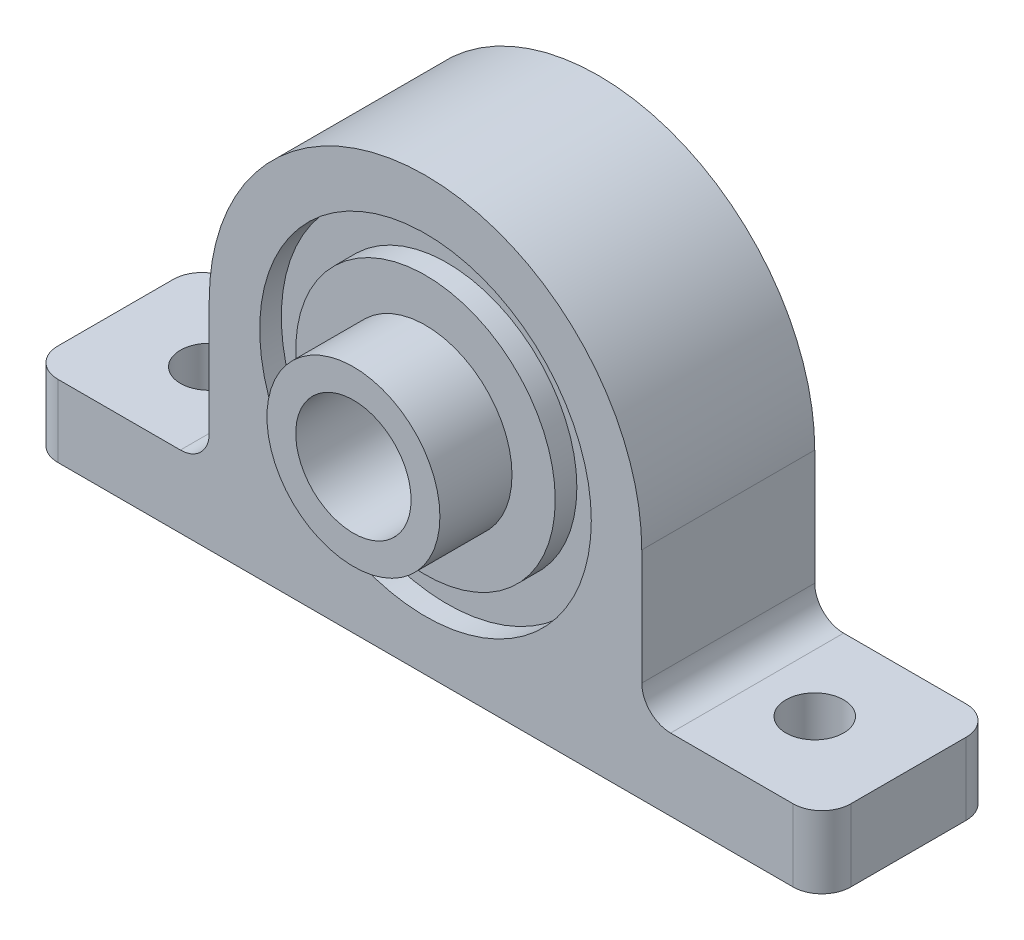
ISO-10303-21;
HEADER;
FILE_DESCRIPTION(('STEP AP214'),'2;1');
FILE_NAME('part.step','',(''),(''),'','','');
FILE_SCHEMA(('AUTOMOTIVE_DESIGN { 1 0 10303 214 1 1 1 1 }'));
ENDSEC;
DATA;
#1=APPLICATION_CONTEXT('core data for automotive mechanical design processes');
#2=APPLICATION_PROTOCOL_DEFINITION('international standard','automotive_design',2000,#1);
#3=PRODUCT_CONTEXT('',#1,'mechanical');
#4=PRODUCT('Part','Part','',(#3));
#5=PRODUCT_RELATED_PRODUCT_CATEGORY('part','',(#4));
#6=PRODUCT_DEFINITION_FORMATION('','',#4);
#7=PRODUCT_DEFINITION_CONTEXT('part definition',#1,'design');
#8=PRODUCT_DEFINITION('design','',#6,#7);
#9=PRODUCT_DEFINITION_SHAPE('','',#8);
#10=(LENGTH_UNIT() NAMED_UNIT(*) SI_UNIT(.MILLI.,.METRE.));
#11=(NAMED_UNIT(*) PLANE_ANGLE_UNIT() SI_UNIT($,.RADIAN.));
#12=(NAMED_UNIT(*) SI_UNIT($,.STERADIAN.) SOLID_ANGLE_UNIT());
#13=UNCERTAINTY_MEASURE_WITH_UNIT(LENGTH_MEASURE(1.E-05),#10,'distance_accuracy_value','');
#14=(GEOMETRIC_REPRESENTATION_CONTEXT(3) GLOBAL_UNCERTAINTY_ASSIGNED_CONTEXT((#13)) GLOBAL_UNIT_ASSIGNED_CONTEXT((#10,
#11,#12)) REPRESENTATION_CONTEXT('',''));
#15=CARTESIAN_POINT('',(0.,0.,0.));
#16=DIRECTION('',(0.,0.,1.));
#17=DIRECTION('',(1.,0.,0.));
#18=AXIS2_PLACEMENT_3D('',#15,#16,#17);
#19=CARTESIAN_POINT('',(17.,-8.,0.));
#20=DIRECTION('',(0.,0.,1.));
#21=DIRECTION('',(1.,0.,0.));
#22=AXIS2_PLACEMENT_3D('',#19,#20,#21);
#23=PLANE('',#22);
#24=CARTESIAN_POINT('',(0.,0.,0.));
#25=DIRECTION('',(0.,0.,1.));
#26=DIRECTION('',(1.,0.,0.));
#27=AXIS2_PLACEMENT_3D('',#24,#25,#26);
#28=CIRCLE('',#27,4.);
#29=CARTESIAN_POINT('',(4.,0.,0.));
#30=VERTEX_POINT('',#29);
#31=EDGE_CURVE('E293',#30,#30,#28,.T.);
#32=ORIENTED_EDGE('',*,*,#31,.T.);
#33=EDGE_LOOP('',(#32));
#34=FACE_BOUND('',#33,.T.);
#35=CARTESIAN_POINT('',(0.,0.,0.));
#36=DIRECTION('',(0.,0.,1.));
#37=DIRECTION('',(1.,0.,0.));
#38=AXIS2_PLACEMENT_3D('',#35,#36,#37);
#39=CIRCLE('',#38,9.);
#40=CARTESIAN_POINT('',(9.,0.,0.));
#41=VERTEX_POINT('',#40);
#42=EDGE_CURVE('E340',#41,#41,#39,.T.);
#43=ORIENTED_EDGE('',*,*,#42,.F.);
#44=EDGE_LOOP('',(#43));
#45=FACE_BOUND('',#44,.T.);
#46=ADVANCED_FACE('F50',(#34,#45),#23,.F.);
#47=CARTESIAN_POINT('',(17.,-8.,12.));
#48=DIRECTION('',(0.,0.,1.));
#49=DIRECTION('',(1.,0.,0.));
#50=AXIS2_PLACEMENT_3D('',#47,#48,#49);
#51=PLANE('',#50);
#52=CARTESIAN_POINT('',(0.,0.,12.));
#53=DIRECTION('',(0.,0.,1.));
#54=DIRECTION('',(1.,0.,0.));
#55=AXIS2_PLACEMENT_3D('',#52,#53,#54);
#56=CIRCLE('',#55,6.);
#57=CARTESIAN_POINT('',(6.,0.,12.));
#58=VERTEX_POINT('',#57);
#59=EDGE_CURVE('E313',#58,#58,#56,.T.);
#60=ORIENTED_EDGE('',*,*,#59,.F.);
#61=EDGE_LOOP('',(#60));
#62=FACE_BOUND('',#61,.T.);
#63=CARTESIAN_POINT('',(0.,0.,12.));
#64=DIRECTION('',(0.,0.,1.));
#65=DIRECTION('',(1.,0.,0.));
#66=AXIS2_PLACEMENT_3D('',#63,#64,#65);
#67=CIRCLE('',#66,9.);
#68=CARTESIAN_POINT('',(9.,0.,12.));
#69=VERTEX_POINT('',#68);
#70=EDGE_CURVE('E328',#69,#69,#67,.T.);
#71=ORIENTED_EDGE('',*,*,#70,.T.);
#72=EDGE_LOOP('',(#71));
#73=FACE_BOUND('',#72,.T.);
#74=ADVANCED_FACE('F356',(#62,#73),#51,.T.);
#75=CARTESIAN_POINT('',(0.,0.,12.));
#76=DIRECTION('',(0.,0.,1.));
#77=DIRECTION('',(1.,0.,0.));
#78=AXIS2_PLACEMENT_3D('',#75,#76,#77);
#79=CIRCLE('',#78,11.5);
#80=CARTESIAN_POINT('',(11.5,0.,12.));
#81=VERTEX_POINT('',#80);
#82=EDGE_CURVE('E322',#81,#81,#79,.T.);
#83=ORIENTED_EDGE('',*,*,#82,.F.);
#84=EDGE_LOOP('',(#83));
#85=FACE_BOUND('',#84,.T.);
#86=DIRECTION('',(1.,0.,0.));
#87=VECTOR('',#86,1.);
#88=CARTESIAN_POINT('',(0.,-15.,12.));
#89=LINE('',#88,#87);
#90=CARTESIAN_POINT('',(-25.5,-15.,12.));
#91=VERTEX_POINT('',#90);
#92=CARTESIAN_POINT('',(25.5,-15.,12.));
#93=VERTEX_POINT('',#92);
#94=EDGE_CURVE('E225',#91,#93,#89,.T.);
#95=ORIENTED_EDGE('',*,*,#94,.T.);
#96=DIRECTION('',(0.,1.,0.));
#97=VECTOR('',#96,1.);
#98=CARTESIAN_POINT('',(25.5,-10.,12.));
#99=LINE('',#98,#97);
#100=CARTESIAN_POINT('',(25.5,-10.,12.));
#101=VERTEX_POINT('',#100);
#102=EDGE_CURVE('E181',#93,#101,#99,.T.);
#103=ORIENTED_EDGE('',*,*,#102,.T.);
#104=DIRECTION('',(-1.,0.,0.));
#105=VECTOR('',#104,1.);
#106=CARTESIAN_POINT('',(17.,-10.,12.));
#107=LINE('',#106,#105);
#108=CARTESIAN_POINT('',(17.,-10.,12.));
#109=VERTEX_POINT('',#108);
#110=EDGE_CURVE('E169',#101,#109,#107,.T.);
#111=ORIENTED_EDGE('',*,*,#110,.T.);
#112=CARTESIAN_POINT('',(17.,-8.,12.));
#113=DIRECTION('',(0.,0.,-1.));
#114=DIRECTION('',(1.,0.,0.));
#115=AXIS2_PLACEMENT_3D('',#112,#113,#114);
#116=CIRCLE('',#115,2.);
#117=CARTESIAN_POINT('',(15.,-7.99999999999999,12.));
#118=VERTEX_POINT('',#117);
#119=EDGE_CURVE('E162',#109,#118,#116,.T.);
#120=ORIENTED_EDGE('',*,*,#119,.T.);
#121=DIRECTION('',(0.,1.,0.));
#122=VECTOR('',#121,1.);
#123=CARTESIAN_POINT('',(15.,0.,12.));
#124=LINE('',#123,#122);
#125=CARTESIAN_POINT('',(15.,0.,12.));
#126=VERTEX_POINT('',#125);
#127=EDGE_CURVE('E151',#118,#126,#124,.T.);
#128=ORIENTED_EDGE('',*,*,#127,.T.);
#129=CARTESIAN_POINT('',(0.,0.,12.));
#130=DIRECTION('',(0.,0.,1.));
#131=DIRECTION('',(1.,0.,0.));
#132=AXIS2_PLACEMENT_3D('',#129,#130,#131);
#133=CIRCLE('',#132,15.);
#134=CARTESIAN_POINT('',(-15.,0.,12.));
#135=VERTEX_POINT('',#134);
#136=EDGE_CURVE('E161',#126,#135,#133,.T.);
#137=ORIENTED_EDGE('',*,*,#136,.T.);
#138=DIRECTION('',(0.,-1.,0.));
#139=VECTOR('',#138,1.);
#140=CARTESIAN_POINT('',(-15.,0.,12.));
#141=LINE('',#140,#139);
#142=CARTESIAN_POINT('',(-15.,-7.99999999999999,12.));
#143=VERTEX_POINT('',#142);
#144=EDGE_CURVE('E254',#135,#143,#141,.T.);
#145=ORIENTED_EDGE('',*,*,#144,.T.);
#146=CARTESIAN_POINT('',(-17.,-8.,12.));
#147=DIRECTION('',(0.,0.,-1.));
#148=DIRECTION('',(1.,0.,0.));
#149=AXIS2_PLACEMENT_3D('',#146,#147,#148);
#150=CIRCLE('',#149,2.);
#151=CARTESIAN_POINT('',(-17.,-10.,12.));
#152=VERTEX_POINT('',#151);
#153=EDGE_CURVE('E223',#143,#152,#150,.T.);
#154=ORIENTED_EDGE('',*,*,#153,.T.);
#155=DIRECTION('',(-1.,0.,0.));
#156=VECTOR('',#155,1.);
#157=CARTESIAN_POINT('',(-27.5,-10.,12.));
#158=LINE('',#157,#156);
#159=CARTESIAN_POINT('',(-25.5,-10.,12.));
#160=VERTEX_POINT('',#159);
#161=EDGE_CURVE('E217',#152,#160,#158,.T.);
#162=ORIENTED_EDGE('',*,*,#161,.T.);
#163=DIRECTION('',(0.,-1.,0.));
#164=VECTOR('',#163,1.);
#165=CARTESIAN_POINT('',(-25.5,-15.,12.));
#166=LINE('',#165,#164);
#167=EDGE_CURVE('E178',#160,#91,#166,.T.);
#168=ORIENTED_EDGE('',*,*,#167,.T.);
#169=EDGE_LOOP('',(#95,#103,#111,#120,#128,#137,#145,#154,#162,#168));
#170=FACE_BOUND('',#169,.T.);
#171=ADVANCED_FACE('F166',(#85,#170),#51,.T.);
#172=CARTESIAN_POINT('',(0.,0.,0.));
#173=DIRECTION('',(0.,0.,1.));
#174=DIRECTION('',(1.,0.,0.));
#175=AXIS2_PLACEMENT_3D('',#172,#173,#174);
#176=CIRCLE('',#175,11.5);
#177=CARTESIAN_POINT('',(11.5,0.,0.));
#178=VERTEX_POINT('',#177);
#179=EDGE_CURVE('E334',#178,#178,#176,.T.);
#180=ORIENTED_EDGE('',*,*,#179,.T.);
#181=EDGE_LOOP('',(#180));
#182=FACE_BOUND('',#181,.T.);
#183=DIRECTION('',(-1.,0.,0.));
#184=VECTOR('',#183,1.);
#185=CARTESIAN_POINT('',(17.,-10.,0.));
#186=LINE('',#185,#184);
#187=CARTESIAN_POINT('',(25.5,-10.,0.));
#188=VERTEX_POINT('',#187);
#189=CARTESIAN_POINT('',(17.,-10.,0.));
#190=VERTEX_POINT('',#189);
#191=EDGE_CURVE('E173',#188,#190,#186,.T.);
#192=ORIENTED_EDGE('',*,*,#191,.F.);
#193=DIRECTION('',(0.,1.,0.));
#194=VECTOR('',#193,1.);
#195=CARTESIAN_POINT('',(25.5,-8.,0.));
#196=LINE('',#195,#194);
#197=CARTESIAN_POINT('',(25.5,-15.,0.));
#198=VERTEX_POINT('',#197);
#199=EDGE_CURVE('E207',#188,#198,#196,.F.);
#200=ORIENTED_EDGE('',*,*,#199,.T.);
#201=DIRECTION('',(1.,0.,0.));
#202=VECTOR('',#201,1.);
#203=CARTESIAN_POINT('',(0.,-15.,0.));
#204=LINE('',#203,#202);
#205=CARTESIAN_POINT('',(-25.5,-15.,0.));
#206=VERTEX_POINT('',#205);
#207=EDGE_CURVE('E272',#206,#198,#204,.T.);
#208=ORIENTED_EDGE('',*,*,#207,.F.);
#209=DIRECTION('',(0.,-1.,0.));
#210=VECTOR('',#209,1.);
#211=CARTESIAN_POINT('',(-25.5,-8.,0.));
#212=LINE('',#211,#210);
#213=CARTESIAN_POINT('',(-25.5,-10.,0.));
#214=VERTEX_POINT('',#213);
#215=EDGE_CURVE('E205',#206,#214,#212,.F.);
#216=ORIENTED_EDGE('',*,*,#215,.T.);
#217=DIRECTION('',(-1.,0.,0.));
#218=VECTOR('',#217,1.);
#219=CARTESIAN_POINT('',(-27.5,-10.,0.));
#220=LINE('',#219,#218);
#221=CARTESIAN_POINT('',(-17.,-10.,0.));
#222=VERTEX_POINT('',#221);
#223=EDGE_CURVE('E265',#222,#214,#220,.T.);
#224=ORIENTED_EDGE('',*,*,#223,.F.);
#225=CARTESIAN_POINT('',(-17.,-8.,0.));
#226=DIRECTION('',(0.,0.,-1.));
#227=DIRECTION('',(1.,0.,0.));
#228=AXIS2_PLACEMENT_3D('',#225,#226,#227);
#229=CIRCLE('',#228,2.);
#230=CARTESIAN_POINT('',(-15.,-7.99999999999999,0.));
#231=VERTEX_POINT('',#230);
#232=EDGE_CURVE('E263',#231,#222,#229,.T.);
#233=ORIENTED_EDGE('',*,*,#232,.F.);
#234=DIRECTION('',(0.,-1.,0.));
#235=VECTOR('',#234,1.);
#236=CARTESIAN_POINT('',(-15.,0.,0.));
#237=LINE('',#236,#235);
#238=CARTESIAN_POINT('',(-15.,0.,0.));
#239=VERTEX_POINT('',#238);
#240=EDGE_CURVE('E253',#239,#231,#237,.T.);
#241=ORIENTED_EDGE('',*,*,#240,.F.);
#242=CARTESIAN_POINT('',(0.,0.,0.));
#243=DIRECTION('',(0.,0.,1.));
#244=DIRECTION('',(1.,0.,0.));
#245=AXIS2_PLACEMENT_3D('',#242,#243,#244);
#246=CIRCLE('',#245,15.);
#247=CARTESIAN_POINT('',(15.,0.,0.));
#248=VERTEX_POINT('',#247);
#249=EDGE_CURVE('E261',#248,#239,#246,.T.);
#250=ORIENTED_EDGE('',*,*,#249,.F.);
#251=DIRECTION('',(0.,1.,0.));
#252=VECTOR('',#251,1.);
#253=CARTESIAN_POINT('',(15.,0.,0.));
#254=LINE('',#253,#252);
#255=CARTESIAN_POINT('',(15.,-7.99999999999999,0.));
#256=VERTEX_POINT('',#255);
#257=EDGE_CURVE('E267',#256,#248,#254,.T.);
#258=ORIENTED_EDGE('',*,*,#257,.F.);
#259=CARTESIAN_POINT('',(17.,-8.,0.));
#260=DIRECTION('',(0.,0.,-1.));
#261=DIRECTION('',(1.,0.,0.));
#262=AXIS2_PLACEMENT_3D('',#259,#260,#261);
#263=CIRCLE('',#262,2.);
#264=EDGE_CURVE('E177',#190,#256,#263,.T.);
#265=ORIENTED_EDGE('',*,*,#264,.F.);
#266=EDGE_LOOP('',(#192,#200,#208,#216,#224,#233,#241,#250,#258,#265));
#267=FACE_BOUND('',#266,.T.);
#268=ADVANCED_FACE('F260',(#182,#267),#23,.F.);
#269=CARTESIAN_POINT('',(17.,-8.,12.));
#270=DIRECTION('',(0.,0.,-1.));
#271=DIRECTION('',(-1.,0.,0.));
#272=AXIS2_PLACEMENT_3D('',#269,#270,#271);
#273=CYLINDRICAL_SURFACE('',#272,2.);
#274=ORIENTED_EDGE('',*,*,#264,.T.);
#275=DIRECTION('',(0.,0.,-1.));
#276=VECTOR('',#275,1.);
#277=CARTESIAN_POINT('',(15.,-7.99999999999999,12.));
#278=LINE('',#277,#276);
#279=EDGE_CURVE('E155',#118,#256,#278,.T.);
#280=ORIENTED_EDGE('',*,*,#279,.F.);
#281=ORIENTED_EDGE('',*,*,#119,.F.);
#282=DIRECTION('',(0.,0.,-1.));
#283=VECTOR('',#282,1.);
#284=CARTESIAN_POINT('',(17.,-10.,12.));
#285=LINE('',#284,#283);
#286=EDGE_CURVE('E276',#109,#190,#285,.T.);
#287=ORIENTED_EDGE('',*,*,#286,.T.);
#288=EDGE_LOOP('',(#274,#280,#281,#287));
#289=FACE_BOUND('',#288,.T.);
#290=ADVANCED_FACE('F175',(#289),#273,.F.);
#291=CARTESIAN_POINT('',(15.,0.,12.));
#292=DIRECTION('',(-1.,0.,0.));
#293=DIRECTION('',(0.,0.,1.));
#294=AXIS2_PLACEMENT_3D('',#291,#292,#293);
#295=PLANE('',#294);
#296=ORIENTED_EDGE('',*,*,#257,.T.);
#297=DIRECTION('',(0.,0.,-1.));
#298=VECTOR('',#297,1.);
#299=CARTESIAN_POINT('',(15.,0.,12.));
#300=LINE('',#299,#298);
#301=EDGE_CURVE('E158',#126,#248,#300,.T.);
#302=ORIENTED_EDGE('',*,*,#301,.F.);
#303=ORIENTED_EDGE('',*,*,#127,.F.);
#304=ORIENTED_EDGE('',*,*,#279,.T.);
#305=EDGE_LOOP('',(#296,#302,#303,#304));
#306=FACE_BOUND('',#305,.T.);
#307=ADVANCED_FACE('F153',(#306),#295,.F.);
#308=CARTESIAN_POINT('',(0.,0.,12.));
#309=DIRECTION('',(0.,0.,-1.));
#310=DIRECTION('',(-1.,0.,0.));
#311=AXIS2_PLACEMENT_3D('',#308,#309,#310);
#312=CYLINDRICAL_SURFACE('',#311,15.);
#313=ORIENTED_EDGE('',*,*,#249,.T.);
#314=DIRECTION('',(0.,0.,-1.));
#315=VECTOR('',#314,1.);
#316=CARTESIAN_POINT('',(-15.,0.,12.));
#317=LINE('',#316,#315);
#318=EDGE_CURVE('E183',#135,#239,#317,.T.);
#319=ORIENTED_EDGE('',*,*,#318,.F.);
#320=ORIENTED_EDGE('',*,*,#136,.F.);
#321=ORIENTED_EDGE('',*,*,#301,.T.);
#322=EDGE_LOOP('',(#313,#319,#320,#321));
#323=FACE_BOUND('',#322,.T.);
#324=ADVANCED_FACE('F294',(#323),#312,.T.);
#325=CARTESIAN_POINT('',(-15.,0.,12.));
#326=DIRECTION('',(1.,0.,0.));
#327=DIRECTION('',(0.,0.,-1.));
#328=AXIS2_PLACEMENT_3D('',#325,#326,#327);
#329=PLANE('',#328);
#330=ORIENTED_EDGE('',*,*,#240,.T.);
#331=DIRECTION('',(0.,0.,-1.));
#332=VECTOR('',#331,1.);
#333=CARTESIAN_POINT('',(-15.,-7.99999999999999,12.));
#334=LINE('',#333,#332);
#335=EDGE_CURVE('E244',#143,#231,#334,.T.);
#336=ORIENTED_EDGE('',*,*,#335,.F.);
#337=ORIENTED_EDGE('',*,*,#144,.F.);
#338=ORIENTED_EDGE('',*,*,#318,.T.);
#339=EDGE_LOOP('',(#330,#336,#337,#338));
#340=FACE_BOUND('',#339,.T.);
#341=ADVANCED_FACE('F251',(#340),#329,.F.);
#342=CARTESIAN_POINT('',(-17.,-8.,12.));
#343=DIRECTION('',(0.,0.,-1.));
#344=DIRECTION('',(-1.,0.,0.));
#345=AXIS2_PLACEMENT_3D('',#342,#343,#344);
#346=CYLINDRICAL_SURFACE('',#345,2.);
#347=ORIENTED_EDGE('',*,*,#232,.T.);
#348=DIRECTION('',(0.,0.,-1.));
#349=VECTOR('',#348,1.);
#350=CARTESIAN_POINT('',(-17.,-10.,12.));
#351=LINE('',#350,#349);
#352=EDGE_CURVE('E236',#152,#222,#351,.T.);
#353=ORIENTED_EDGE('',*,*,#352,.F.);
#354=ORIENTED_EDGE('',*,*,#153,.F.);
#355=ORIENTED_EDGE('',*,*,#335,.T.);
#356=EDGE_LOOP('',(#347,#353,#354,#355));
#357=FACE_BOUND('',#356,.T.);
#358=ADVANCED_FACE('F439',(#357),#346,.F.);
#359=CARTESIAN_POINT('',(-27.5,-10.,12.));
#360=DIRECTION('',(0.,-1.,0.));
#361=DIRECTION('',(0.,0.,-1.));
#362=AXIS2_PLACEMENT_3D('',#359,#360,#361);
#363=PLANE('',#362);
#364=CARTESIAN_POINT('',(-21.,-10.,6.00000000000001));
#365=DIRECTION('',(0.,1.,0.));
#366=DIRECTION('',(0.,0.,1.));
#367=AXIS2_PLACEMENT_3D('',#364,#365,#366);
#368=CIRCLE('',#367,2.);
#369=CARTESIAN_POINT('',(-21.,-10.,8.00000000000001));
#370=VERTEX_POINT('',#369);
#371=EDGE_CURVE('E308',#370,#370,#368,.T.);
#372=ORIENTED_EDGE('',*,*,#371,.F.);
#373=EDGE_LOOP('',(#372));
#374=FACE_BOUND('',#373,.T.);
#375=ORIENTED_EDGE('',*,*,#223,.T.);
#376=CARTESIAN_POINT('',(-25.5,-10.,2.));
#377=DIRECTION('',(0.,-1.,0.));
#378=DIRECTION('',(0.,0.,-1.));
#379=AXIS2_PLACEMENT_3D('',#376,#377,#378);
#380=CIRCLE('',#379,2.);
#381=CARTESIAN_POINT('',(-27.5,-10.,2.));
#382=VERTEX_POINT('',#381);
#383=EDGE_CURVE('E13',#214,#382,#380,.F.);
#384=ORIENTED_EDGE('',*,*,#383,.T.);
#385=DIRECTION('',(0.,0.,-1.));
#386=VECTOR('',#385,1.);
#387=CARTESIAN_POINT('',(-27.5,-10.,12.));
#388=LINE('',#387,#386);
#389=CARTESIAN_POINT('',(-27.5,-10.,10.));
#390=VERTEX_POINT('',#389);
#391=EDGE_CURVE('E218',#390,#382,#388,.T.);
#392=ORIENTED_EDGE('',*,*,#391,.F.);
#393=CARTESIAN_POINT('',(-25.5,-10.,10.));
#394=DIRECTION('',(0.,-1.,0.));
#395=DIRECTION('',(0.,0.,-1.));
#396=AXIS2_PLACEMENT_3D('',#393,#394,#395);
#397=CIRCLE('',#396,2.);
#398=EDGE_CURVE('E58',#390,#160,#397,.F.);
#399=ORIENTED_EDGE('',*,*,#398,.T.);
#400=ORIENTED_EDGE('',*,*,#161,.F.);
#401=ORIENTED_EDGE('',*,*,#352,.T.);
#402=EDGE_LOOP('',(#375,#384,#392,#399,#400,#401));
#403=FACE_BOUND('',#402,.T.);
#404=ADVANCED_FACE('F215',(#374,#403),#363,.F.);
#405=CARTESIAN_POINT('',(-27.5,-15.,12.));
#406=DIRECTION('',(1.,0.,0.));
#407=DIRECTION('',(0.,0.,-1.));
#408=AXIS2_PLACEMENT_3D('',#405,#406,#407);
#409=PLANE('',#408);
#410=ORIENTED_EDGE('',*,*,#391,.T.);
#411=DIRECTION('',(0.,-1.,0.));
#412=VECTOR('',#411,1.);
#413=CARTESIAN_POINT('',(-27.5,-15.,2.));
#414=LINE('',#413,#412);
#415=CARTESIAN_POINT('',(-27.5,-15.,2.));
#416=VERTEX_POINT('',#415);
#417=EDGE_CURVE('E210',#382,#416,#414,.T.);
#418=ORIENTED_EDGE('',*,*,#417,.T.);
#419=DIRECTION('',(0.,0.,-1.));
#420=VECTOR('',#419,1.);
#421=CARTESIAN_POINT('',(-27.5,-15.,12.));
#422=LINE('',#421,#420);
#423=CARTESIAN_POINT('',(-27.5,-15.,10.));
#424=VERTEX_POINT('',#423);
#425=EDGE_CURVE('E231',#424,#416,#422,.T.);
#426=ORIENTED_EDGE('',*,*,#425,.F.);
#427=DIRECTION('',(0.,-1.,0.));
#428=VECTOR('',#427,1.);
#429=CARTESIAN_POINT('',(-27.5,-10.,10.));
#430=LINE('',#429,#428);
#431=EDGE_CURVE('E70',#424,#390,#430,.F.);
#432=ORIENTED_EDGE('',*,*,#431,.T.);
#433=EDGE_LOOP('',(#410,#418,#426,#432));
#434=FACE_BOUND('',#433,.T.);
#435=ADVANCED_FACE('F232',(#434),#409,.F.);
#436=CARTESIAN_POINT('',(0.,-15.,12.));
#437=DIRECTION('',(0.,1.,0.));
#438=DIRECTION('',(0.,0.,1.));
#439=AXIS2_PLACEMENT_3D('',#436,#437,#438);
#440=PLANE('',#439);
#441=CARTESIAN_POINT('',(-21.,-15.,6.00000000000001));
#442=DIRECTION('',(0.,1.,0.));
#443=DIRECTION('',(0.,0.,1.));
#444=AXIS2_PLACEMENT_3D('',#441,#442,#443);
#445=CIRCLE('',#444,2.);
#446=CARTESIAN_POINT('',(-21.,-15.,8.00000000000001));
#447=VERTEX_POINT('',#446);
#448=EDGE_CURVE('E300',#447,#447,#445,.T.);
#449=ORIENTED_EDGE('',*,*,#448,.T.);
#450=EDGE_LOOP('',(#449));
#451=FACE_BOUND('',#450,.T.);
#452=CARTESIAN_POINT('',(21.,-15.,6.00000000000001));
#453=DIRECTION('',(0.,1.,0.));
#454=DIRECTION('',(0.,0.,1.));
#455=AXIS2_PLACEMENT_3D('',#452,#453,#454);
#456=CIRCLE('',#455,2.);
#457=CARTESIAN_POINT('',(21.,-15.,8.00000000000001));
#458=VERTEX_POINT('',#457);
#459=EDGE_CURVE('E304',#458,#458,#456,.T.);
#460=ORIENTED_EDGE('',*,*,#459,.T.);
#461=EDGE_LOOP('',(#460));
#462=FACE_BOUND('',#461,.T.);
#463=DIRECTION('',(0.,0.,-1.));
#464=VECTOR('',#463,1.);
#465=CARTESIAN_POINT('',(27.5,-15.,12.));
#466=LINE('',#465,#464);
#467=CARTESIAN_POINT('',(27.5,-15.,10.));
#468=VERTEX_POINT('',#467);
#469=CARTESIAN_POINT('',(27.5,-15.,2.));
#470=VERTEX_POINT('',#469);
#471=EDGE_CURVE('E234',#468,#470,#466,.T.);
#472=ORIENTED_EDGE('',*,*,#471,.F.);
#473=CARTESIAN_POINT('',(25.5,-15.,10.));
#474=DIRECTION('',(0.,1.,0.));
#475=DIRECTION('',(0.,0.,1.));
#476=AXIS2_PLACEMENT_3D('',#473,#474,#475);
#477=CIRCLE('',#476,2.);
#478=EDGE_CURVE('E203',#468,#93,#477,.F.);
#479=ORIENTED_EDGE('',*,*,#478,.T.);
#480=ORIENTED_EDGE('',*,*,#94,.F.);
#481=CARTESIAN_POINT('',(-25.5,-15.,10.));
#482=DIRECTION('',(0.,1.,0.));
#483=DIRECTION('',(0.,0.,1.));
#484=AXIS2_PLACEMENT_3D('',#481,#482,#483);
#485=CIRCLE('',#484,2.);
#486=EDGE_CURVE('E197',#91,#424,#485,.F.);
#487=ORIENTED_EDGE('',*,*,#486,.T.);
#488=ORIENTED_EDGE('',*,*,#425,.T.);
#489=CARTESIAN_POINT('',(-25.5,-15.,2.));
#490=DIRECTION('',(0.,1.,0.));
#491=DIRECTION('',(0.,0.,1.));
#492=AXIS2_PLACEMENT_3D('',#489,#490,#491);
#493=CIRCLE('',#492,2.);
#494=EDGE_CURVE('E199',#416,#206,#493,.F.);
#495=ORIENTED_EDGE('',*,*,#494,.T.);
#496=ORIENTED_EDGE('',*,*,#207,.T.);
#497=CARTESIAN_POINT('',(25.5,-15.,2.));
#498=DIRECTION('',(0.,1.,0.));
#499=DIRECTION('',(0.,0.,1.));
#500=AXIS2_PLACEMENT_3D('',#497,#498,#499);
#501=CIRCLE('',#500,2.);
#502=EDGE_CURVE('E201',#198,#470,#501,.F.);
#503=ORIENTED_EDGE('',*,*,#502,.T.);
#504=EDGE_LOOP('',(#472,#479,#480,#487,#488,#495,#496,#503));
#505=FACE_BOUND('',#504,.T.);
#506=ADVANCED_FACE('F230',(#451,#462,#505),#440,.F.);
#507=CARTESIAN_POINT('',(27.5,-10.,12.));
#508=DIRECTION('',(-1.,0.,0.));
#509=DIRECTION('',(0.,0.,1.));
#510=AXIS2_PLACEMENT_3D('',#507,#508,#509);
#511=PLANE('',#510);
#512=DIRECTION('',(0.,0.,-1.));
#513=VECTOR('',#512,1.);
#514=CARTESIAN_POINT('',(27.5,-10.,12.));
#515=LINE('',#514,#513);
#516=CARTESIAN_POINT('',(27.5,-10.,10.));
#517=VERTEX_POINT('',#516);
#518=CARTESIAN_POINT('',(27.5,-10.,2.));
#519=VERTEX_POINT('',#518);
#520=EDGE_CURVE('E239',#517,#519,#515,.T.);
#521=ORIENTED_EDGE('',*,*,#520,.F.);
#522=DIRECTION('',(0.,1.,0.));
#523=VECTOR('',#522,1.);
#524=CARTESIAN_POINT('',(27.5,-15.,10.));
#525=LINE('',#524,#523);
#526=EDGE_CURVE('E195',#517,#468,#525,.F.);
#527=ORIENTED_EDGE('',*,*,#526,.T.);
#528=ORIENTED_EDGE('',*,*,#471,.T.);
#529=DIRECTION('',(0.,1.,0.));
#530=VECTOR('',#529,1.);
#531=CARTESIAN_POINT('',(27.5,-10.,2.));
#532=LINE('',#531,#530);
#533=EDGE_CURVE('E192',#470,#519,#532,.T.);
#534=ORIENTED_EDGE('',*,*,#533,.T.);
#535=EDGE_LOOP('',(#521,#527,#528,#534));
#536=FACE_BOUND('',#535,.T.);
#537=ADVANCED_FACE('F283',(#536),#511,.F.);
#538=CARTESIAN_POINT('',(17.,-10.,12.));
#539=DIRECTION('',(0.,-1.,0.));
#540=DIRECTION('',(0.,0.,-1.));
#541=AXIS2_PLACEMENT_3D('',#538,#539,#540);
#542=PLANE('',#541);
#543=CARTESIAN_POINT('',(21.,-10.,6.00000000000001));
#544=DIRECTION('',(0.,1.,0.));
#545=DIRECTION('',(0.,0.,1.));
#546=AXIS2_PLACEMENT_3D('',#543,#544,#545);
#547=CIRCLE('',#546,2.);
#548=CARTESIAN_POINT('',(21.,-10.,8.00000000000001));
#549=VERTEX_POINT('',#548);
#550=EDGE_CURVE('E301',#549,#549,#547,.T.);
#551=ORIENTED_EDGE('',*,*,#550,.F.);
#552=EDGE_LOOP('',(#551));
#553=FACE_BOUND('',#552,.T.);
#554=ORIENTED_EDGE('',*,*,#110,.F.);
#555=CARTESIAN_POINT('',(25.5,-10.,10.));
#556=DIRECTION('',(0.,-1.,0.));
#557=DIRECTION('',(0.,0.,-1.));
#558=AXIS2_PLACEMENT_3D('',#555,#556,#557);
#559=CIRCLE('',#558,2.);
#560=EDGE_CURVE('E190',#101,#517,#559,.F.);
#561=ORIENTED_EDGE('',*,*,#560,.T.);
#562=ORIENTED_EDGE('',*,*,#520,.T.);
#563=CARTESIAN_POINT('',(25.5,-10.,2.));
#564=DIRECTION('',(0.,-1.,0.));
#565=DIRECTION('',(0.,0.,-1.));
#566=AXIS2_PLACEMENT_3D('',#563,#564,#565);
#567=CIRCLE('',#566,2.);
#568=EDGE_CURVE('E188',#519,#188,#567,.F.);
#569=ORIENTED_EDGE('',*,*,#568,.T.);
#570=ORIENTED_EDGE('',*,*,#191,.T.);
#571=ORIENTED_EDGE('',*,*,#286,.F.);
#572=EDGE_LOOP('',(#554,#561,#562,#569,#570,#571));
#573=FACE_BOUND('',#572,.T.);
#574=ADVANCED_FACE('F280',(#553,#573),#542,.F.);
#575=CARTESIAN_POINT('',(0.,0.,12.));
#576=DIRECTION('',(0.,0.,-1.));
#577=DIRECTION('',(-1.,0.,0.));
#578=AXIS2_PLACEMENT_3D('',#575,#576,#577);
#579=CYLINDRICAL_SURFACE('',#578,4.);
#580=ORIENTED_EDGE('',*,*,#31,.F.);
#581=EDGE_LOOP('',(#580));
#582=FACE_BOUND('',#581,.T.);
#583=CARTESIAN_POINT('',(0.,0.,17.));
#584=DIRECTION('',(0.,0.,1.));
#585=DIRECTION('',(1.,0.,0.));
#586=AXIS2_PLACEMENT_3D('',#583,#584,#585);
#587=CIRCLE('',#586,4.);
#588=CARTESIAN_POINT('',(4.,0.,17.));
#589=VERTEX_POINT('',#588);
#590=EDGE_CURVE('E316',#589,#589,#587,.T.);
#591=ORIENTED_EDGE('',*,*,#590,.T.);
#592=EDGE_LOOP('',(#591));
#593=FACE_BOUND('',#592,.T.);
#594=ADVANCED_FACE('F412',(#582,#593),#579,.F.);
#595=CARTESIAN_POINT('',(25.5,-8.,10.));
#596=DIRECTION('',(0.,-1.,0.));
#597=DIRECTION('',(0.,0.,-1.));
#598=AXIS2_PLACEMENT_3D('',#595,#596,#597);
#599=CYLINDRICAL_SURFACE('',#598,2.);
#600=ORIENTED_EDGE('',*,*,#478,.F.);
#601=ORIENTED_EDGE('',*,*,#526,.F.);
#602=ORIENTED_EDGE('',*,*,#560,.F.);
#603=ORIENTED_EDGE('',*,*,#102,.F.);
#604=EDGE_LOOP('',(#600,#601,#602,#603));
#605=FACE_BOUND('',#604,.T.);
#606=ADVANCED_FACE('F287',(#605),#599,.T.);
#607=CARTESIAN_POINT('',(25.5,-10.,2.));
#608=DIRECTION('',(0.,1.,0.));
#609=DIRECTION('',(0.,0.,1.));
#610=AXIS2_PLACEMENT_3D('',#607,#608,#609);
#611=CYLINDRICAL_SURFACE('',#610,2.);
#612=ORIENTED_EDGE('',*,*,#502,.F.);
#613=ORIENTED_EDGE('',*,*,#199,.F.);
#614=ORIENTED_EDGE('',*,*,#568,.F.);
#615=ORIENTED_EDGE('',*,*,#533,.F.);
#616=EDGE_LOOP('',(#612,#613,#614,#615));
#617=FACE_BOUND('',#616,.T.);
#618=ADVANCED_FACE('F419',(#617),#611,.T.);
#619=CARTESIAN_POINT('',(-25.5,-15.,2.));
#620=DIRECTION('',(0.,-1.,0.));
#621=DIRECTION('',(0.,0.,-1.));
#622=AXIS2_PLACEMENT_3D('',#619,#620,#621);
#623=CYLINDRICAL_SURFACE('',#622,2.);
#624=ORIENTED_EDGE('',*,*,#383,.F.);
#625=ORIENTED_EDGE('',*,*,#215,.F.);
#626=ORIENTED_EDGE('',*,*,#494,.F.);
#627=ORIENTED_EDGE('',*,*,#417,.F.);
#628=EDGE_LOOP('',(#624,#625,#626,#627));
#629=FACE_BOUND('',#628,.T.);
#630=ADVANCED_FACE('F451',(#629),#623,.T.);
#631=CARTESIAN_POINT('',(-25.5,-8.,10.));
#632=DIRECTION('',(0.,1.,0.));
#633=DIRECTION('',(0.,0.,1.));
#634=AXIS2_PLACEMENT_3D('',#631,#632,#633);
#635=CYLINDRICAL_SURFACE('',#634,2.);
#636=ORIENTED_EDGE('',*,*,#398,.F.);
#637=ORIENTED_EDGE('',*,*,#431,.F.);
#638=ORIENTED_EDGE('',*,*,#486,.F.);
#639=ORIENTED_EDGE('',*,*,#167,.F.);
#640=EDGE_LOOP('',(#636,#637,#638,#639));
#641=FACE_BOUND('',#640,.T.);
#642=ADVANCED_FACE('F52',(#641),#635,.T.);
#643=CARTESIAN_POINT('',(21.,-15.,6.00000000000001));
#644=DIRECTION('',(0.,1.,0.));
#645=DIRECTION('',(0.,0.,1.));
#646=AXIS2_PLACEMENT_3D('',#643,#644,#645);
#647=CYLINDRICAL_SURFACE('',#646,2.);
#648=ORIENTED_EDGE('',*,*,#459,.F.);
#649=EDGE_LOOP('',(#648));
#650=FACE_BOUND('',#649,.T.);
#651=ORIENTED_EDGE('',*,*,#550,.T.);
#652=EDGE_LOOP('',(#651));
#653=FACE_BOUND('',#652,.T.);
#654=ADVANCED_FACE('F407',(#650,#653),#647,.F.);
#655=CARTESIAN_POINT('',(-21.,-15.,6.00000000000001));
#656=DIRECTION('',(0.,1.,0.));
#657=DIRECTION('',(0.,0.,1.));
#658=AXIS2_PLACEMENT_3D('',#655,#656,#657);
#659=CYLINDRICAL_SURFACE('',#658,2.);
#660=ORIENTED_EDGE('',*,*,#448,.F.);
#661=EDGE_LOOP('',(#660));
#662=FACE_BOUND('',#661,.T.);
#663=ORIENTED_EDGE('',*,*,#371,.T.);
#664=EDGE_LOOP('',(#663));
#665=FACE_BOUND('',#664,.T.);
#666=ADVANCED_FACE('F400',(#662,#665),#659,.F.);
#667=CARTESIAN_POINT('',(0.,0.,17.));
#668=DIRECTION('',(0.,0.,1.));
#669=DIRECTION('',(1.,0.,0.));
#670=AXIS2_PLACEMENT_3D('',#667,#668,#669);
#671=PLANE('',#670);
#672=CARTESIAN_POINT('',(0.,0.,17.));
#673=DIRECTION('',(0.,0.,1.));
#674=DIRECTION('',(1.,0.,0.));
#675=AXIS2_PLACEMENT_3D('',#672,#673,#674);
#676=CIRCLE('',#675,6.);
#677=CARTESIAN_POINT('',(6.,0.,17.));
#678=VERTEX_POINT('',#677);
#679=EDGE_CURVE('E305',#678,#678,#676,.T.);
#680=ORIENTED_EDGE('',*,*,#679,.T.);
#681=EDGE_LOOP('',(#680));
#682=FACE_BOUND('',#681,.T.);
#683=ORIENTED_EDGE('',*,*,#590,.F.);
#684=EDGE_LOOP('',(#683));
#685=FACE_BOUND('',#684,.T.);
#686=ADVANCED_FACE('F397',(#682,#685),#671,.T.);
#687=CARTESIAN_POINT('',(0.,0.,17.));
#688=DIRECTION('',(0.,0.,-1.));
#689=DIRECTION('',(-1.,0.,0.));
#690=AXIS2_PLACEMENT_3D('',#687,#688,#689);
#691=CYLINDRICAL_SURFACE('',#690,6.);
#692=ORIENTED_EDGE('',*,*,#679,.F.);
#693=EDGE_LOOP('',(#692));
#694=FACE_BOUND('',#693,.T.);
#695=ORIENTED_EDGE('',*,*,#59,.T.);
#696=EDGE_LOOP('',(#695));
#697=FACE_BOUND('',#696,.T.);
#698=ADVANCED_FACE('F395',(#694,#697),#691,.T.);
#699=CARTESIAN_POINT('',(0.,0.,10.5));
#700=DIRECTION('',(0.,0.,1.));
#701=DIRECTION('',(1.,0.,0.));
#702=AXIS2_PLACEMENT_3D('',#699,#700,#701);
#703=CYLINDRICAL_SURFACE('',#702,11.5);
#704=CARTESIAN_POINT('',(0.,0.,10.5));
#705=DIRECTION('',(0.,0.,1.));
#706=DIRECTION('',(1.,0.,0.));
#707=AXIS2_PLACEMENT_3D('',#704,#705,#706);
#708=CIRCLE('',#707,11.5);
#709=CARTESIAN_POINT('',(11.5,0.,10.5));
#710=VERTEX_POINT('',#709);
#711=EDGE_CURVE('E321',#710,#710,#708,.T.);
#712=ORIENTED_EDGE('',*,*,#711,.F.);
#713=EDGE_LOOP('',(#712));
#714=FACE_BOUND('',#713,.T.);
#715=ORIENTED_EDGE('',*,*,#82,.T.);
#716=EDGE_LOOP('',(#715));
#717=FACE_BOUND('',#716,.T.);
#718=ADVANCED_FACE('F391',(#714,#717),#703,.F.);
#719=CARTESIAN_POINT('',(0.,0.,10.5));
#720=DIRECTION('',(0.,0.,1.));
#721=DIRECTION('',(1.,0.,0.));
#722=AXIS2_PLACEMENT_3D('',#719,#720,#721);
#723=PLANE('',#722);
#724=CARTESIAN_POINT('',(0.,0.,10.5));
#725=DIRECTION('',(0.,0.,1.));
#726=DIRECTION('',(1.,0.,0.));
#727=AXIS2_PLACEMENT_3D('',#724,#725,#726);
#728=CIRCLE('',#727,9.);
#729=CARTESIAN_POINT('',(9.,0.,10.5));
#730=VERTEX_POINT('',#729);
#731=EDGE_CURVE('E325',#730,#730,#728,.T.);
#732=ORIENTED_EDGE('',*,*,#731,.F.);
#733=EDGE_LOOP('',(#732));
#734=FACE_BOUND('',#733,.T.);
#735=ORIENTED_EDGE('',*,*,#711,.T.);
#736=EDGE_LOOP('',(#735));
#737=FACE_BOUND('',#736,.T.);
#738=ADVANCED_FACE('F387',(#734,#737),#723,.T.);
#739=CARTESIAN_POINT('',(0.,0.,10.5));
#740=DIRECTION('',(0.,0.,1.));
#741=DIRECTION('',(1.,0.,0.));
#742=AXIS2_PLACEMENT_3D('',#739,#740,#741);
#743=CYLINDRICAL_SURFACE('',#742,9.);
#744=ORIENTED_EDGE('',*,*,#731,.T.);
#745=EDGE_LOOP('',(#744));
#746=FACE_BOUND('',#745,.T.);
#747=ORIENTED_EDGE('',*,*,#70,.F.);
#748=EDGE_LOOP('',(#747));
#749=FACE_BOUND('',#748,.T.);
#750=ADVANCED_FACE('F381',(#746,#749),#743,.T.);
#751=CARTESIAN_POINT('',(0.,0.,1.5));
#752=DIRECTION('',(0.,0.,-1.));
#753=DIRECTION('',(1.,0.,0.));
#754=AXIS2_PLACEMENT_3D('',#751,#752,#753);
#755=PLANE('',#754);
#756=CARTESIAN_POINT('',(0.,0.,1.5));
#757=DIRECTION('',(0.,0.,1.));
#758=DIRECTION('',(1.,0.,0.));
#759=AXIS2_PLACEMENT_3D('',#756,#757,#758);
#760=CIRCLE('',#759,11.5);
#761=CARTESIAN_POINT('',(11.5,0.,1.5));
#762=VERTEX_POINT('',#761);
#763=EDGE_CURVE('E331',#762,#762,#760,.T.);
#764=ORIENTED_EDGE('',*,*,#763,.F.);
#765=EDGE_LOOP('',(#764));
#766=FACE_BOUND('',#765,.T.);
#767=CARTESIAN_POINT('',(0.,0.,1.5));
#768=DIRECTION('',(0.,0.,1.));
#769=DIRECTION('',(1.,0.,0.));
#770=AXIS2_PLACEMENT_3D('',#767,#768,#769);
#771=CIRCLE('',#770,9.);
#772=CARTESIAN_POINT('',(9.,0.,1.5));
#773=VERTEX_POINT('',#772);
#774=EDGE_CURVE('E337',#773,#773,#771,.T.);
#775=ORIENTED_EDGE('',*,*,#774,.T.);
#776=EDGE_LOOP('',(#775));
#777=FACE_BOUND('',#776,.T.);
#778=ADVANCED_FACE('F346',(#766,#777),#755,.T.);
#779=CARTESIAN_POINT('',(0.,0.,1.5));
#780=DIRECTION('',(0.,0.,-1.));
#781=DIRECTION('',(-1.,0.,0.));
#782=AXIS2_PLACEMENT_3D('',#779,#780,#781);
#783=CYLINDRICAL_SURFACE('',#782,11.5);
#784=ORIENTED_EDGE('',*,*,#763,.T.);
#785=EDGE_LOOP('',(#784));
#786=FACE_BOUND('',#785,.T.);
#787=ORIENTED_EDGE('',*,*,#179,.F.);
#788=EDGE_LOOP('',(#787));
#789=FACE_BOUND('',#788,.T.);
#790=ADVANCED_FACE('F351',(#786,#789),#783,.F.);
#791=CARTESIAN_POINT('',(0.,0.,1.5));
#792=DIRECTION('',(0.,0.,-1.));
#793=DIRECTION('',(-1.,0.,0.));
#794=AXIS2_PLACEMENT_3D('',#791,#792,#793);
#795=CYLINDRICAL_SURFACE('',#794,9.);
#796=ORIENTED_EDGE('',*,*,#774,.F.);
#797=EDGE_LOOP('',(#796));
#798=FACE_BOUND('',#797,.T.);
#799=ORIENTED_EDGE('',*,*,#42,.T.);
#800=EDGE_LOOP('',(#799));
#801=FACE_BOUND('',#800,.T.);
#802=ADVANCED_FACE('F348',(#798,#801),#795,.T.);
#803=CLOSED_SHELL('',(#46,#74,#171,#268,#290,#307,#324,#341,#358,#404,#435,#506,#537,#574,#594,
#606,#618,#630,#642,#654,#666,#686,#698,#718,#738,#750,#778,#790,#802));
#804=MANIFOLD_SOLID_BREP('B2',#803);
#805=ADVANCED_BREP_SHAPE_REPRESENTATION('',(#18,#804),#14);
#806=SHAPE_DEFINITION_REPRESENTATION(#9,#805);
ENDSEC;
END-ISO-10303-21;
